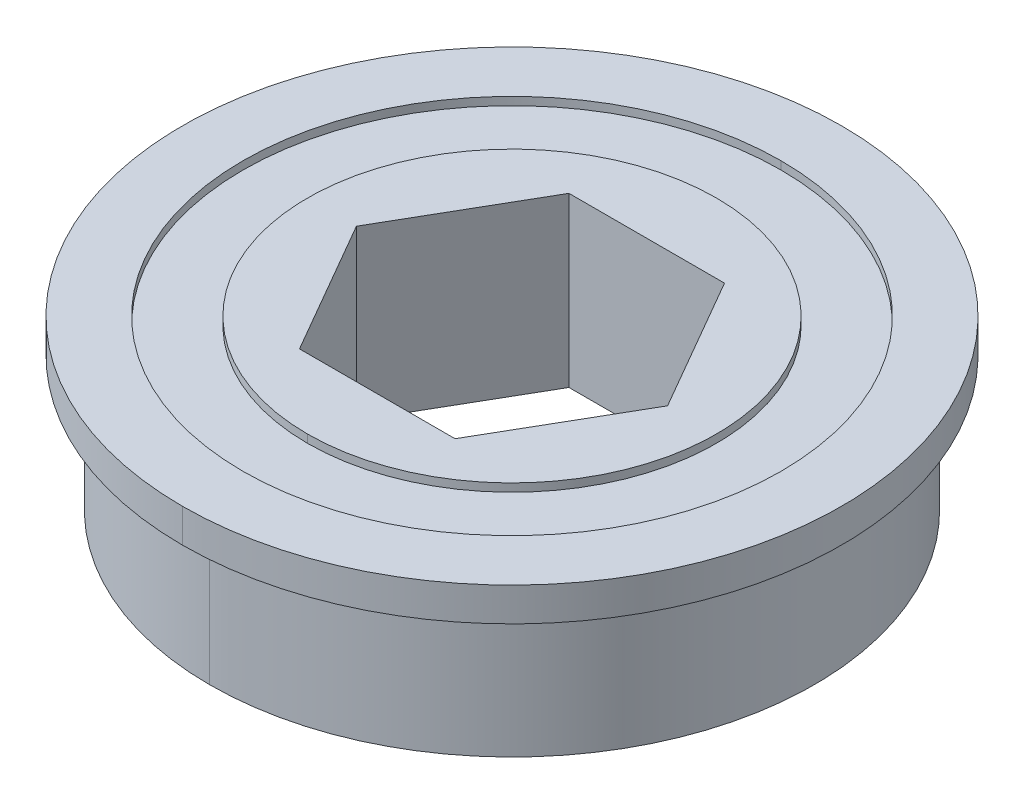
ISO-10303-21;
HEADER;
FILE_DESCRIPTION(('STEP AP214'),'2;1');
FILE_NAME('part.step','',(''),(''),'','','');
FILE_SCHEMA(('AUTOMOTIVE_DESIGN { 1 0 10303 214 1 1 1 1 }'));
ENDSEC;
DATA;
#1=APPLICATION_CONTEXT('core data for automotive mechanical design processes');
#2=APPLICATION_PROTOCOL_DEFINITION('international standard','automotive_design',2000,#1);
#3=PRODUCT_CONTEXT('',#1,'mechanical');
#4=PRODUCT('Part','Part','',(#3));
#5=PRODUCT_RELATED_PRODUCT_CATEGORY('part','',(#4));
#6=PRODUCT_DEFINITION_FORMATION('','',#4);
#7=PRODUCT_DEFINITION_CONTEXT('part definition',#1,'design');
#8=PRODUCT_DEFINITION('design','',#6,#7);
#9=PRODUCT_DEFINITION_SHAPE('','',#8);
#10=(LENGTH_UNIT() NAMED_UNIT(*) SI_UNIT(.MILLI.,.METRE.));
#11=(NAMED_UNIT(*) PLANE_ANGLE_UNIT() SI_UNIT($,.RADIAN.));
#12=(NAMED_UNIT(*) SI_UNIT($,.STERADIAN.) SOLID_ANGLE_UNIT());
#13=UNCERTAINTY_MEASURE_WITH_UNIT(LENGTH_MEASURE(1.E-05),#10,'distance_accuracy_value','');
#14=(GEOMETRIC_REPRESENTATION_CONTEXT(3) GLOBAL_UNCERTAINTY_ASSIGNED_CONTEXT((#13)) GLOBAL_UNIT_ASSIGNED_CONTEXT((#10,
#11,#12)) REPRESENTATION_CONTEXT('',''));
#15=CARTESIAN_POINT('',(0.,0.,0.));
#16=DIRECTION('',(0.,0.,1.));
#17=DIRECTION('',(1.,0.,0.));
#18=AXIS2_PLACEMENT_3D('',#15,#16,#17);
#19=CARTESIAN_POINT('',(3.67194771204602,0.,-6.36));
#20=DIRECTION('',(0.,0.,-1.));
#21=DIRECTION('',(-1.,0.,0.));
#22=AXIS2_PLACEMENT_3D('',#19,#20,#21);
#23=PLANE('',#22);
#24=DIRECTION('',(-1.,0.,0.));
#25=VECTOR('',#24,1.);
#26=CARTESIAN_POINT('',(3.67194771204602,7.9375,-6.36));
#27=LINE('',#26,#25);
#28=CARTESIAN_POINT('',(3.67194771204602,7.9375,-6.36));
#29=VERTEX_POINT('',#28);
#30=CARTESIAN_POINT('',(-3.67194771204602,7.9375,-6.36));
#31=VERTEX_POINT('',#30);
#32=EDGE_CURVE('E279',#29,#31,#27,.T.);
#33=ORIENTED_EDGE('',*,*,#32,.T.);
#34=DIRECTION('',(0.,1.,0.));
#35=VECTOR('',#34,1.);
#36=CARTESIAN_POINT('',(-3.67194771204602,0.,-6.36));
#37=LINE('',#36,#35);
#38=CARTESIAN_POINT('',(-3.67194771204602,0.,-6.36));
#39=VERTEX_POINT('',#38);
#40=EDGE_CURVE('E10',#39,#31,#37,.T.);
#41=ORIENTED_EDGE('',*,*,#40,.F.);
#42=DIRECTION('',(-1.,0.,0.));
#43=VECTOR('',#42,1.);
#44=CARTESIAN_POINT('',(3.67194771204602,0.,-6.36));
#45=LINE('',#44,#43);
#46=CARTESIAN_POINT('',(3.67194771204602,0.,-6.36));
#47=VERTEX_POINT('',#46);
#48=EDGE_CURVE('E259',#47,#39,#45,.T.);
#49=ORIENTED_EDGE('',*,*,#48,.F.);
#50=DIRECTION('',(0.,1.,0.));
#51=VECTOR('',#50,1.);
#52=CARTESIAN_POINT('',(3.67194771204602,0.,-6.36));
#53=LINE('',#52,#51);
#54=EDGE_CURVE('E275',#47,#29,#53,.T.);
#55=ORIENTED_EDGE('',*,*,#54,.T.);
#56=EDGE_LOOP('',(#33,#41,#49,#55));
#57=FACE_BOUND('',#56,.T.);
#58=ADVANCED_FACE('F16',(#57),#23,.F.);
#59=CARTESIAN_POINT('',(-3.67194771204602,0.,-6.36));
#60=DIRECTION('',(-0.866025403784439,0.,-0.5));
#61=DIRECTION('',(-0.5,0.,0.866025403784439));
#62=AXIS2_PLACEMENT_3D('',#59,#60,#61);
#63=PLANE('',#62);
#64=DIRECTION('',(-0.5,0.,0.866025403784439));
#65=VECTOR('',#64,1.);
#66=CARTESIAN_POINT('',(-3.67194771204602,7.9375,-6.36));
#67=LINE('',#66,#65);
#68=CARTESIAN_POINT('',(-7.34389542409204,7.9375,0.));
#69=VERTEX_POINT('',#68);
#70=EDGE_CURVE('E301',#31,#69,#67,.T.);
#71=ORIENTED_EDGE('',*,*,#70,.T.);
#72=DIRECTION('',(0.,1.,0.));
#73=VECTOR('',#72,1.);
#74=CARTESIAN_POINT('',(-7.34389542409204,0.,0.));
#75=LINE('',#74,#73);
#76=CARTESIAN_POINT('',(-7.34389542409204,0.,0.));
#77=VERTEX_POINT('',#76);
#78=EDGE_CURVE('E27',#77,#69,#75,.T.);
#79=ORIENTED_EDGE('',*,*,#78,.F.);
#80=DIRECTION('',(-0.5,0.,0.866025403784439));
#81=VECTOR('',#80,1.);
#82=CARTESIAN_POINT('',(-3.67194771204602,0.,-6.36));
#83=LINE('',#82,#81);
#84=EDGE_CURVE('E254',#39,#77,#83,.T.);
#85=ORIENTED_EDGE('',*,*,#84,.F.);
#86=ORIENTED_EDGE('',*,*,#40,.T.);
#87=EDGE_LOOP('',(#71,#79,#85,#86));
#88=FACE_BOUND('',#87,.T.);
#89=ADVANCED_FACE('F492',(#88),#63,.F.);
#90=CARTESIAN_POINT('',(-7.34389542409204,0.,0.));
#91=DIRECTION('',(-0.866025403784439,0.,0.5));
#92=DIRECTION('',(0.,1.,0.));
#93=AXIS2_PLACEMENT_3D('',#90,#91,#92);
#94=PLANE('',#93);
#95=DIRECTION('',(0.5,0.,0.866025403784439));
#96=VECTOR('',#95,1.);
#97=CARTESIAN_POINT('',(-7.34389542409204,7.9375,0.));
#98=LINE('',#97,#96);
#99=CARTESIAN_POINT('',(-3.67194771204601,7.9375,6.36));
#100=VERTEX_POINT('',#99);
#101=EDGE_CURVE('E304',#69,#100,#98,.T.);
#102=ORIENTED_EDGE('',*,*,#101,.T.);
#103=DIRECTION('',(0.,1.,0.));
#104=VECTOR('',#103,1.);
#105=CARTESIAN_POINT('',(-3.67194771204601,0.,6.36));
#106=LINE('',#105,#104);
#107=CARTESIAN_POINT('',(-3.67194771204601,0.,6.36));
#108=VERTEX_POINT('',#107);
#109=EDGE_CURVE('E341',#108,#100,#106,.T.);
#110=ORIENTED_EDGE('',*,*,#109,.F.);
#111=DIRECTION('',(0.5,0.,0.866025403784439));
#112=VECTOR('',#111,1.);
#113=CARTESIAN_POINT('',(-7.34389542409204,0.,0.));
#114=LINE('',#113,#112);
#115=EDGE_CURVE('E258',#77,#108,#114,.T.);
#116=ORIENTED_EDGE('',*,*,#115,.F.);
#117=ORIENTED_EDGE('',*,*,#78,.T.);
#118=EDGE_LOOP('',(#102,#110,#116,#117));
#119=FACE_BOUND('',#118,.T.);
#120=ADVANCED_FACE('F18',(#119),#94,.F.);
#121=CARTESIAN_POINT('',(-3.67194771204601,0.,6.36));
#122=DIRECTION('',(0.,0.,1.));
#123=DIRECTION('',(1.,0.,0.));
#124=AXIS2_PLACEMENT_3D('',#121,#122,#123);
#125=PLANE('',#124);
#126=DIRECTION('',(1.,0.,0.));
#127=VECTOR('',#126,1.);
#128=CARTESIAN_POINT('',(-3.67194771204601,7.9375,6.36));
#129=LINE('',#128,#127);
#130=CARTESIAN_POINT('',(3.67194771204602,7.9375,6.36));
#131=VERTEX_POINT('',#130);
#132=EDGE_CURVE('E322',#100,#131,#129,.T.);
#133=ORIENTED_EDGE('',*,*,#132,.T.);
#134=DIRECTION('',(0.,1.,0.));
#135=VECTOR('',#134,1.);
#136=CARTESIAN_POINT('',(3.67194771204602,0.,6.36));
#137=LINE('',#136,#135);
#138=CARTESIAN_POINT('',(3.67194771204602,0.,6.36));
#139=VERTEX_POINT('',#138);
#140=EDGE_CURVE('E338',#139,#131,#137,.T.);
#141=ORIENTED_EDGE('',*,*,#140,.F.);
#142=DIRECTION('',(1.,0.,0.));
#143=VECTOR('',#142,1.);
#144=CARTESIAN_POINT('',(-3.67194771204601,0.,6.36));
#145=LINE('',#144,#143);
#146=EDGE_CURVE('E384',#108,#139,#145,.T.);
#147=ORIENTED_EDGE('',*,*,#146,.F.);
#148=ORIENTED_EDGE('',*,*,#109,.T.);
#149=EDGE_LOOP('',(#133,#141,#147,#148));
#150=FACE_BOUND('',#149,.T.);
#151=ADVANCED_FACE('F512',(#150),#125,.F.);
#152=CARTESIAN_POINT('',(3.67194771204602,0.,6.36));
#153=DIRECTION('',(0.866025403784439,0.,0.5));
#154=DIRECTION('',(0.,-1.,0.));
#155=AXIS2_PLACEMENT_3D('',#152,#153,#154);
#156=PLANE('',#155);
#157=DIRECTION('',(0.5,0.,-0.866025403784439));
#158=VECTOR('',#157,1.);
#159=CARTESIAN_POINT('',(3.67194771204602,7.9375,6.36));
#160=LINE('',#159,#158);
#161=CARTESIAN_POINT('',(7.34389542409204,7.9375,0.));
#162=VERTEX_POINT('',#161);
#163=EDGE_CURVE('E315',#131,#162,#160,.T.);
#164=ORIENTED_EDGE('',*,*,#163,.T.);
#165=DIRECTION('',(0.,1.,0.));
#166=VECTOR('',#165,1.);
#167=CARTESIAN_POINT('',(7.34389542409204,0.,0.));
#168=LINE('',#167,#166);
#169=CARTESIAN_POINT('',(7.34389542409204,0.,0.));
#170=VERTEX_POINT('',#169);
#171=EDGE_CURVE('E278',#170,#162,#168,.T.);
#172=ORIENTED_EDGE('',*,*,#171,.F.);
#173=DIRECTION('',(0.5,0.,-0.866025403784439));
#174=VECTOR('',#173,1.);
#175=CARTESIAN_POINT('',(3.67194771204602,0.,6.36));
#176=LINE('',#175,#174);
#177=EDGE_CURVE('E316',#139,#170,#176,.T.);
#178=ORIENTED_EDGE('',*,*,#177,.F.);
#179=ORIENTED_EDGE('',*,*,#140,.T.);
#180=EDGE_LOOP('',(#164,#172,#178,#179));
#181=FACE_BOUND('',#180,.T.);
#182=ADVANCED_FACE('F514',(#181),#156,.F.);
#183=CARTESIAN_POINT('',(7.34389542409204,0.,0.));
#184=DIRECTION('',(0.866025403784439,0.,-0.5));
#185=DIRECTION('',(0.,-1.,0.));
#186=AXIS2_PLACEMENT_3D('',#183,#184,#185);
#187=PLANE('',#186);
#188=DIRECTION('',(-0.5,0.,-0.866025403784439));
#189=VECTOR('',#188,1.);
#190=CARTESIAN_POINT('',(7.34389542409204,7.9375,0.));
#191=LINE('',#190,#189);
#192=EDGE_CURVE('E311',#162,#29,#191,.T.);
#193=ORIENTED_EDGE('',*,*,#192,.T.);
#194=ORIENTED_EDGE('',*,*,#54,.F.);
#195=DIRECTION('',(-0.5,0.,-0.866025403784439));
#196=VECTOR('',#195,1.);
#197=CARTESIAN_POINT('',(7.34389542409204,0.,0.));
#198=LINE('',#197,#196);
#199=EDGE_CURVE('E260',#170,#47,#198,.T.);
#200=ORIENTED_EDGE('',*,*,#199,.F.);
#201=ORIENTED_EDGE('',*,*,#171,.T.);
#202=EDGE_LOOP('',(#193,#194,#200,#201));
#203=FACE_BOUND('',#202,.T.);
#204=ADVANCED_FACE('F572',(#203),#187,.F.);
#205=CARTESIAN_POINT('',(6.35,7.9375,0.));
#206=DIRECTION('',(0.,1.,0.));
#207=DIRECTION('',(1.,0.,0.));
#208=AXIS2_PLACEMENT_3D('',#205,#206,#207);
#209=PLANE('',#208);
#210=ORIENTED_EDGE('',*,*,#192,.F.);
#211=ORIENTED_EDGE('',*,*,#163,.F.);
#212=ORIENTED_EDGE('',*,*,#132,.F.);
#213=ORIENTED_EDGE('',*,*,#101,.F.);
#214=ORIENTED_EDGE('',*,*,#70,.F.);
#215=ORIENTED_EDGE('',*,*,#32,.F.);
#216=EDGE_LOOP('',(#210,#211,#212,#213,#214,#215));
#217=FACE_BOUND('',#216,.T.);
#218=CARTESIAN_POINT('',(0.,7.9375,0.));
#219=DIRECTION('',(0.,1.,0.));
#220=DIRECTION('',(0.,0.,1.));
#221=AXIS2_PLACEMENT_3D('',#218,#219,#220);
#222=CIRCLE('',#221,9.652);
#223=CARTESIAN_POINT('',(0.,7.9375,9.652));
#224=VERTEX_POINT('',#223);
#225=CARTESIAN_POINT('',(0.,7.9375,-9.652));
#226=VERTEX_POINT('',#225);
#227=EDGE_CURVE('E305',#224,#226,#222,.T.);
#228=ORIENTED_EDGE('',*,*,#227,.T.);
#229=CARTESIAN_POINT('',(0.,7.9375,0.));
#230=DIRECTION('',(0.,1.,0.));
#231=DIRECTION('',(0.,0.,1.));
#232=AXIS2_PLACEMENT_3D('',#229,#230,#231);
#233=CIRCLE('',#232,9.652);
#234=EDGE_CURVE('E397',#226,#224,#233,.T.);
#235=ORIENTED_EDGE('',*,*,#234,.T.);
#236=EDGE_LOOP('',(#228,#235));
#237=FACE_BOUND('',#236,.T.);
#238=ADVANCED_FACE('F537',(#217,#237),#209,.T.);
#239=CARTESIAN_POINT('',(9.652,0.,0.));
#240=DIRECTION('',(0.,-1.,0.));
#241=DIRECTION('',(0.,0.,-1.));
#242=AXIS2_PLACEMENT_3D('',#239,#240,#241);
#243=PLANE('',#242);
#244=ORIENTED_EDGE('',*,*,#199,.T.);
#245=ORIENTED_EDGE('',*,*,#48,.T.);
#246=ORIENTED_EDGE('',*,*,#84,.T.);
#247=ORIENTED_EDGE('',*,*,#115,.T.);
#248=ORIENTED_EDGE('',*,*,#146,.T.);
#249=ORIENTED_EDGE('',*,*,#177,.T.);
#250=EDGE_LOOP('',(#244,#245,#246,#247,#248,#249));
#251=FACE_BOUND('',#250,.T.);
#252=CARTESIAN_POINT('',(0.,0.,0.));
#253=DIRECTION('',(0.,1.,0.));
#254=DIRECTION('',(0.,0.,1.));
#255=AXIS2_PLACEMENT_3D('',#252,#253,#254);
#256=CIRCLE('',#255,9.652);
#257=CARTESIAN_POINT('',(0.,0.,9.652));
#258=VERTEX_POINT('',#257);
#259=CARTESIAN_POINT('',(0.,0.,-9.652));
#260=VERTEX_POINT('',#259);
#261=EDGE_CURVE('E245',#258,#260,#256,.T.);
#262=ORIENTED_EDGE('',*,*,#261,.F.);
#263=CARTESIAN_POINT('',(0.,0.,0.));
#264=DIRECTION('',(0.,1.,0.));
#265=DIRECTION('',(0.,0.,1.));
#266=AXIS2_PLACEMENT_3D('',#263,#264,#265);
#267=CIRCLE('',#266,9.652);
#268=EDGE_CURVE('E234',#260,#258,#267,.T.);
#269=ORIENTED_EDGE('',*,*,#268,.F.);
#270=EDGE_LOOP('',(#262,#269));
#271=FACE_BOUND('',#270,.T.);
#272=ADVANCED_FACE('F534',(#251,#271),#243,.T.);
#273=CARTESIAN_POINT('',(0.,0.,0.));
#274=DIRECTION('',(0.,1.,0.));
#275=DIRECTION('',(0.,0.,1.));
#276=AXIS2_PLACEMENT_3D('',#273,#274,#275);
#277=CYLINDRICAL_SURFACE('',#276,9.652);
#278=DIRECTION('',(0.,1.,0.));
#279=VECTOR('',#278,1.);
#280=CARTESIAN_POINT('',(0.,0.,-9.652));
#281=LINE('',#280,#279);
#282=CARTESIAN_POINT('',(0.,0.381,-9.652));
#283=VERTEX_POINT('',#282);
#284=EDGE_CURVE('E227',#260,#283,#281,.T.);
#285=ORIENTED_EDGE('',*,*,#284,.F.);
#286=ORIENTED_EDGE('',*,*,#268,.T.);
#287=DIRECTION('',(0.,1.,0.));
#288=VECTOR('',#287,1.);
#289=CARTESIAN_POINT('',(0.,0.,9.652));
#290=LINE('',#289,#288);
#291=CARTESIAN_POINT('',(0.,0.381,9.652));
#292=VERTEX_POINT('',#291);
#293=EDGE_CURVE('E230',#258,#292,#290,.T.);
#294=ORIENTED_EDGE('',*,*,#293,.T.);
#295=CARTESIAN_POINT('',(0.,0.381,0.));
#296=DIRECTION('',(0.,1.,0.));
#297=DIRECTION('',(0.,0.,1.));
#298=AXIS2_PLACEMENT_3D('',#295,#296,#297);
#299=CIRCLE('',#298,9.652);
#300=EDGE_CURVE('E223',#283,#292,#299,.T.);
#301=ORIENTED_EDGE('',*,*,#300,.F.);
#302=EDGE_LOOP('',(#285,#286,#294,#301));
#303=FACE_BOUND('',#302,.T.);
#304=ADVANCED_FACE('F225',(#303),#277,.T.);
#305=CARTESIAN_POINT('',(9.652,0.381,0.));
#306=DIRECTION('',(0.,-1.,0.));
#307=DIRECTION('',(0.,0.,-1.));
#308=AXIS2_PLACEMENT_3D('',#305,#306,#307);
#309=PLANE('',#308);
#310=CARTESIAN_POINT('',(0.,0.381,0.));
#311=DIRECTION('',(0.,1.,0.));
#312=DIRECTION('',(0.,0.,1.));
#313=AXIS2_PLACEMENT_3D('',#310,#311,#312);
#314=CIRCLE('',#313,9.652);
#315=EDGE_CURVE('E237',#292,#283,#314,.T.);
#316=ORIENTED_EDGE('',*,*,#315,.T.);
#317=ORIENTED_EDGE('',*,*,#300,.T.);
#318=EDGE_LOOP('',(#316,#317));
#319=FACE_BOUND('',#318,.T.);
#320=CARTESIAN_POINT('',(0.,0.381,0.));
#321=DIRECTION('',(0.,1.,0.));
#322=DIRECTION('',(0.,0.,1.));
#323=AXIS2_PLACEMENT_3D('',#320,#321,#322);
#324=CIRCLE('',#323,12.7);
#325=CARTESIAN_POINT('',(0.,0.381,12.7));
#326=VERTEX_POINT('',#325);
#327=CARTESIAN_POINT('',(0.,0.381,-12.7));
#328=VERTEX_POINT('',#327);
#329=EDGE_CURVE('E235',#326,#328,#324,.T.);
#330=ORIENTED_EDGE('',*,*,#329,.F.);
#331=CARTESIAN_POINT('',(0.,0.381,0.));
#332=DIRECTION('',(0.,1.,0.));
#333=DIRECTION('',(0.,0.,1.));
#334=AXIS2_PLACEMENT_3D('',#331,#332,#333);
#335=CIRCLE('',#334,12.7);
#336=EDGE_CURVE('E295',#328,#326,#335,.T.);
#337=ORIENTED_EDGE('',*,*,#336,.F.);
#338=EDGE_LOOP('',(#330,#337));
#339=FACE_BOUND('',#338,.T.);
#340=ADVANCED_FACE('F238',(#319,#339),#309,.T.);
#341=CARTESIAN_POINT('',(0.,0.,0.));
#342=DIRECTION('',(0.,1.,0.));
#343=DIRECTION('',(0.,0.,1.));
#344=AXIS2_PLACEMENT_3D('',#341,#342,#343);
#345=CYLINDRICAL_SURFACE('',#344,12.7);
#346=DIRECTION('',(0.,1.,0.));
#347=VECTOR('',#346,1.);
#348=CARTESIAN_POINT('',(0.,0.,-12.7));
#349=LINE('',#348,#347);
#350=CARTESIAN_POINT('',(0.,0.,-12.7));
#351=VERTEX_POINT('',#350);
#352=EDGE_CURVE('E291',#351,#328,#349,.T.);
#353=ORIENTED_EDGE('',*,*,#352,.F.);
#354=CARTESIAN_POINT('',(0.,0.,0.));
#355=DIRECTION('',(0.,1.,0.));
#356=DIRECTION('',(0.,0.,1.));
#357=AXIS2_PLACEMENT_3D('',#354,#355,#356);
#358=CIRCLE('',#357,12.7);
#359=CARTESIAN_POINT('',(0.,0.,12.7));
#360=VERTEX_POINT('',#359);
#361=EDGE_CURVE('E342',#360,#351,#358,.T.);
#362=ORIENTED_EDGE('',*,*,#361,.F.);
#363=DIRECTION('',(0.,1.,0.));
#364=VECTOR('',#363,1.);
#365=CARTESIAN_POINT('',(0.,0.,12.7));
#366=LINE('',#365,#364);
#367=EDGE_CURVE('E418',#360,#326,#366,.T.);
#368=ORIENTED_EDGE('',*,*,#367,.T.);
#369=ORIENTED_EDGE('',*,*,#329,.T.);
#370=EDGE_LOOP('',(#353,#362,#368,#369));
#371=FACE_BOUND('',#370,.T.);
#372=ADVANCED_FACE('F477',(#371),#345,.F.);
#373=CARTESIAN_POINT('',(14.2748,0.,0.));
#374=DIRECTION('',(0.,-1.,0.));
#375=DIRECTION('',(0.,0.,-1.));
#376=AXIS2_PLACEMENT_3D('',#373,#374,#375);
#377=PLANE('',#376);
#378=ORIENTED_EDGE('',*,*,#361,.T.);
#379=CARTESIAN_POINT('',(0.,0.,0.));
#380=DIRECTION('',(0.,1.,0.));
#381=DIRECTION('',(0.,0.,1.));
#382=AXIS2_PLACEMENT_3D('',#379,#380,#381);
#383=CIRCLE('',#382,12.7);
#384=EDGE_CURVE('E282',#351,#360,#383,.T.);
#385=ORIENTED_EDGE('',*,*,#384,.T.);
#386=EDGE_LOOP('',(#378,#385));
#387=FACE_BOUND('',#386,.T.);
#388=CARTESIAN_POINT('',(0.,0.,0.));
#389=DIRECTION('',(0.,1.,0.));
#390=DIRECTION('',(0.,0.,1.));
#391=AXIS2_PLACEMENT_3D('',#388,#389,#390);
#392=CIRCLE('',#391,14.2748);
#393=CARTESIAN_POINT('',(0.,0.,14.2748));
#394=VERTEX_POINT('',#393);
#395=CARTESIAN_POINT('',(0.,0.,-14.2748));
#396=VERTEX_POINT('',#395);
#397=EDGE_CURVE('E363',#394,#396,#392,.T.);
#398=ORIENTED_EDGE('',*,*,#397,.F.);
#399=CARTESIAN_POINT('',(0.,0.,0.));
#400=DIRECTION('',(0.,1.,0.));
#401=DIRECTION('',(0.,0.,1.));
#402=AXIS2_PLACEMENT_3D('',#399,#400,#401);
#403=CIRCLE('',#402,14.2748);
#404=EDGE_CURVE('E111',#396,#394,#403,.T.);
#405=ORIENTED_EDGE('',*,*,#404,.F.);
#406=EDGE_LOOP('',(#398,#405));
#407=FACE_BOUND('',#406,.T.);
#408=ADVANCED_FACE('F475',(#387,#407),#377,.T.);
#409=CARTESIAN_POINT('',(0.,0.,0.));
#410=DIRECTION('',(0.,1.,0.));
#411=DIRECTION('',(0.,0.,1.));
#412=AXIS2_PLACEMENT_3D('',#409,#410,#411);
#413=CYLINDRICAL_SURFACE('',#412,14.2748);
#414=DIRECTION('',(0.,1.,0.));
#415=VECTOR('',#414,1.);
#416=CARTESIAN_POINT('',(0.,0.,-14.2748));
#417=LINE('',#416,#415);
#418=CARTESIAN_POINT('',(0.,5.6,-14.2748));
#419=VERTEX_POINT('',#418);
#420=EDGE_CURVE('E358',#396,#419,#417,.T.);
#421=ORIENTED_EDGE('',*,*,#420,.F.);
#422=ORIENTED_EDGE('',*,*,#404,.T.);
#423=DIRECTION('',(0.,1.,0.));
#424=VECTOR('',#423,1.);
#425=CARTESIAN_POINT('',(0.,0.,14.2748));
#426=LINE('',#425,#424);
#427=CARTESIAN_POINT('',(0.,5.6,14.2748));
#428=VERTEX_POINT('',#427);
#429=EDGE_CURVE('E404',#394,#428,#426,.T.);
#430=ORIENTED_EDGE('',*,*,#429,.T.);
#431=CARTESIAN_POINT('',(0.,5.6,0.));
#432=DIRECTION('',(0.,1.,0.));
#433=DIRECTION('',(0.,0.,1.));
#434=AXIS2_PLACEMENT_3D('',#431,#432,#433);
#435=CIRCLE('',#434,14.2748);
#436=EDGE_CURVE('E96',#419,#428,#435,.T.);
#437=ORIENTED_EDGE('',*,*,#436,.F.);
#438=EDGE_LOOP('',(#421,#422,#430,#437));
#439=FACE_BOUND('',#438,.T.);
#440=ADVANCED_FACE('F472',(#439),#413,.T.);
#441=CARTESIAN_POINT('',(0.,5.975,0.));
#442=DIRECTION('',(0.,-1.,0.));
#443=DIRECTION('',(0.,0.,-1.));
#444=AXIS2_PLACEMENT_3D('',#441,#442,#443);
#445=CONICAL_SURFACE('',#444,14.0582936490539,0.523598775598298);
#446=DIRECTION('',(0.,-0.86602540378444,0.5));
#447=VECTOR('',#446,1.);
#448=CARTESIAN_POINT('',(0.,5.975,14.0582936490539));
#449=LINE('',#448,#447);
#450=CARTESIAN_POINT('',(0.,5.975,14.0582936490539));
#451=VERTEX_POINT('',#450);
#452=EDGE_CURVE('E274',#451,#428,#449,.T.);
#453=ORIENTED_EDGE('',*,*,#452,.F.);
#454=CARTESIAN_POINT('',(0.,5.975,0.));
#455=DIRECTION('',(0.,1.,0.));
#456=DIRECTION('',(0.,0.,1.));
#457=AXIS2_PLACEMENT_3D('',#454,#455,#456);
#458=CIRCLE('',#457,14.0582936490539);
#459=CARTESIAN_POINT('',(0.,5.975,-14.0582936490539));
#460=VERTEX_POINT('',#459);
#461=EDGE_CURVE('E290',#460,#451,#458,.T.);
#462=ORIENTED_EDGE('',*,*,#461,.F.);
#463=DIRECTION('',(0.,-0.86602540378444,-0.5));
#464=VECTOR('',#463,1.);
#465=CARTESIAN_POINT('',(0.,5.975,-14.0582936490539));
#466=LINE('',#465,#464);
#467=EDGE_CURVE('E270',#460,#419,#466,.T.);
#468=ORIENTED_EDGE('',*,*,#467,.T.);
#469=ORIENTED_EDGE('',*,*,#436,.T.);
#470=EDGE_LOOP('',(#453,#462,#468,#469));
#471=FACE_BOUND('',#470,.T.);
#472=ADVANCED_FACE('F485',(#471),#445,.T.);
#473=CARTESIAN_POINT('',(0.,6.1,0.));
#474=DIRECTION('',(0.,1.,0.));
#475=DIRECTION('',(0.,0.,1.));
#476=AXIS2_PLACEMENT_3D('',#473,#474,#475);
#477=TOROIDAL_SURFACE('',#476,14.2748,0.25);
#478=CARTESIAN_POINT('',(0.,6.1,0.));
#479=DIRECTION('',(0.,1.,0.));
#480=DIRECTION('',(0.,0.,1.));
#481=AXIS2_PLACEMENT_3D('',#478,#479,#480);
#482=CIRCLE('',#481,14.0248);
#483=CARTESIAN_POINT('',(0.,6.1,14.0248));
#484=VERTEX_POINT('',#483);
#485=CARTESIAN_POINT('',(0.,6.1,-14.0248));
#486=VERTEX_POINT('',#485);
#487=EDGE_CURVE('E317',#484,#486,#482,.T.);
#488=ORIENTED_EDGE('',*,*,#487,.F.);
#489=CARTESIAN_POINT('',(0.,6.1,14.2748));
#490=DIRECTION('',(-1.,0.,0.));
#491=DIRECTION('',(0.,0.,1.));
#492=AXIS2_PLACEMENT_3D('',#489,#490,#491);
#493=CIRCLE('',#492,0.25);
#494=EDGE_CURVE('E351',#484,#451,#493,.T.);
#495=ORIENTED_EDGE('',*,*,#494,.T.);
#496=CARTESIAN_POINT('',(0.,5.975,0.));
#497=DIRECTION('',(0.,1.,0.));
#498=DIRECTION('',(0.,0.,1.));
#499=AXIS2_PLACEMENT_3D('',#496,#497,#498);
#500=CIRCLE('',#499,14.0582936490539);
#501=EDGE_CURVE('E401',#451,#460,#500,.T.);
#502=ORIENTED_EDGE('',*,*,#501,.T.);
#503=CARTESIAN_POINT('',(0.,6.1,-14.2748));
#504=DIRECTION('',(1.,0.,0.));
#505=DIRECTION('',(0.,0.,-1.));
#506=AXIS2_PLACEMENT_3D('',#503,#504,#505);
#507=CIRCLE('',#506,0.25);
#508=EDGE_CURVE('E273',#486,#460,#507,.T.);
#509=ORIENTED_EDGE('',*,*,#508,.F.);
#510=EDGE_LOOP('',(#488,#495,#502,#509));
#511=FACE_BOUND('',#510,.T.);
#512=ADVANCED_FACE('F524',(#511),#477,.F.);
#513=CARTESIAN_POINT('',(15.5575,6.35,0.));
#514=DIRECTION('',(0.,-1.,0.));
#515=DIRECTION('',(0.,0.,-1.));
#516=AXIS2_PLACEMENT_3D('',#513,#514,#515);
#517=PLANE('',#516);
#518=CARTESIAN_POINT('',(0.,6.35,0.));
#519=DIRECTION('',(0.,1.,0.));
#520=DIRECTION('',(0.,0.,1.));
#521=AXIS2_PLACEMENT_3D('',#518,#519,#520);
#522=CIRCLE('',#521,14.2748);
#523=CARTESIAN_POINT('',(0.,6.35,14.2748));
#524=VERTEX_POINT('',#523);
#525=CARTESIAN_POINT('',(0.,6.35,-14.2748));
#526=VERTEX_POINT('',#525);
#527=EDGE_CURVE('E300',#524,#526,#522,.T.);
#528=ORIENTED_EDGE('',*,*,#527,.T.);
#529=CARTESIAN_POINT('',(0.,6.35,0.));
#530=DIRECTION('',(0.,1.,0.));
#531=DIRECTION('',(0.,0.,1.));
#532=AXIS2_PLACEMENT_3D('',#529,#530,#531);
#533=CIRCLE('',#532,14.2748);
#534=EDGE_CURVE('E251',#526,#524,#533,.T.);
#535=ORIENTED_EDGE('',*,*,#534,.T.);
#536=EDGE_LOOP('',(#528,#535));
#537=FACE_BOUND('',#536,.T.);
#538=CARTESIAN_POINT('',(0.,6.35,0.));
#539=DIRECTION('',(0.,1.,0.));
#540=DIRECTION('',(0.,0.,1.));
#541=AXIS2_PLACEMENT_3D('',#538,#539,#540);
#542=CIRCLE('',#541,15.5575);
#543=CARTESIAN_POINT('',(0.,6.35,15.5575));
#544=VERTEX_POINT('',#543);
#545=CARTESIAN_POINT('',(0.,6.35,-15.5575));
#546=VERTEX_POINT('',#545);
#547=EDGE_CURVE('E355',#544,#546,#542,.T.);
#548=ORIENTED_EDGE('',*,*,#547,.F.);
#549=CARTESIAN_POINT('',(0.,6.35,0.));
#550=DIRECTION('',(0.,1.,0.));
#551=DIRECTION('',(0.,0.,1.));
#552=AXIS2_PLACEMENT_3D('',#549,#550,#551);
#553=CIRCLE('',#552,15.5575);
#554=EDGE_CURVE('E400',#546,#544,#553,.T.);
#555=ORIENTED_EDGE('',*,*,#554,.F.);
#556=EDGE_LOOP('',(#548,#555));
#557=FACE_BOUND('',#556,.T.);
#558=ADVANCED_FACE('F539',(#537,#557),#517,.T.);
#559=CARTESIAN_POINT('',(0.,0.,0.));
#560=DIRECTION('',(0.,1.,0.));
#561=DIRECTION('',(0.,0.,1.));
#562=AXIS2_PLACEMENT_3D('',#559,#560,#561);
#563=CYLINDRICAL_SURFACE('',#562,15.5575);
#564=DIRECTION('',(0.,1.,0.));
#565=VECTOR('',#564,1.);
#566=CARTESIAN_POINT('',(0.,0.,-15.5575));
#567=LINE('',#566,#565);
#568=CARTESIAN_POINT('',(0.,7.9375,-15.5575));
#569=VERTEX_POINT('',#568);
#570=EDGE_CURVE('E335',#546,#569,#567,.T.);
#571=ORIENTED_EDGE('',*,*,#570,.F.);
#572=ORIENTED_EDGE('',*,*,#554,.T.);
#573=DIRECTION('',(0.,1.,0.));
#574=VECTOR('',#573,1.);
#575=CARTESIAN_POINT('',(0.,0.,15.5575));
#576=LINE('',#575,#574);
#577=CARTESIAN_POINT('',(0.,7.9375,15.5575));
#578=VERTEX_POINT('',#577);
#579=EDGE_CURVE('E269',#544,#578,#576,.T.);
#580=ORIENTED_EDGE('',*,*,#579,.T.);
#581=CARTESIAN_POINT('',(0.,7.9375,0.));
#582=DIRECTION('',(0.,1.,0.));
#583=DIRECTION('',(0.,0.,1.));
#584=AXIS2_PLACEMENT_3D('',#581,#582,#583);
#585=CIRCLE('',#584,15.5575);
#586=EDGE_CURVE('E179',#569,#578,#585,.T.);
#587=ORIENTED_EDGE('',*,*,#586,.F.);
#588=EDGE_LOOP('',(#571,#572,#580,#587));
#589=FACE_BOUND('',#588,.T.);
#590=ADVANCED_FACE('F542',(#589),#563,.T.);
#591=CARTESIAN_POINT('',(12.7,7.9375,0.));
#592=DIRECTION('',(0.,1.,0.));
#593=DIRECTION('',(1.,0.,0.));
#594=AXIS2_PLACEMENT_3D('',#591,#592,#593);
#595=PLANE('',#594);
#596=CARTESIAN_POINT('',(0.,7.9375,0.));
#597=DIRECTION('',(0.,1.,0.));
#598=DIRECTION('',(0.,0.,1.));
#599=AXIS2_PLACEMENT_3D('',#596,#597,#598);
#600=CIRCLE('',#599,12.7);
#601=CARTESIAN_POINT('',(0.,7.9375,12.7));
#602=VERTEX_POINT('',#601);
#603=CARTESIAN_POINT('',(0.,7.9375,-12.7));
#604=VERTEX_POINT('',#603);
#605=EDGE_CURVE('E283',#602,#604,#600,.T.);
#606=ORIENTED_EDGE('',*,*,#605,.F.);
#607=CARTESIAN_POINT('',(0.,7.9375,0.));
#608=DIRECTION('',(0.,1.,0.));
#609=DIRECTION('',(0.,0.,1.));
#610=AXIS2_PLACEMENT_3D('',#607,#608,#609);
#611=CIRCLE('',#610,12.7);
#612=EDGE_CURVE('E331',#604,#602,#611,.T.);
#613=ORIENTED_EDGE('',*,*,#612,.F.);
#614=EDGE_LOOP('',(#606,#613));
#615=FACE_BOUND('',#614,.T.);
#616=CARTESIAN_POINT('',(0.,7.9375,0.));
#617=DIRECTION('',(0.,1.,0.));
#618=DIRECTION('',(0.,0.,1.));
#619=AXIS2_PLACEMENT_3D('',#616,#617,#618);
#620=CIRCLE('',#619,15.5575);
#621=EDGE_CURVE('E332',#578,#569,#620,.T.);
#622=ORIENTED_EDGE('',*,*,#621,.T.);
#623=ORIENTED_EDGE('',*,*,#586,.T.);
#624=EDGE_LOOP('',(#622,#623));
#625=FACE_BOUND('',#624,.T.);
#626=ADVANCED_FACE('F527',(#615,#625),#595,.T.);
#627=CARTESIAN_POINT('',(0.,0.,0.));
#628=DIRECTION('',(0.,1.,0.));
#629=DIRECTION('',(0.,0.,1.));
#630=AXIS2_PLACEMENT_3D('',#627,#628,#629);
#631=CYLINDRICAL_SURFACE('',#630,12.7);
#632=DIRECTION('',(0.,1.,0.));
#633=VECTOR('',#632,1.);
#634=CARTESIAN_POINT('',(0.,0.,-12.7));
#635=LINE('',#634,#633);
#636=CARTESIAN_POINT('',(0.,7.5565,-12.7));
#637=VERTEX_POINT('',#636);
#638=EDGE_CURVE('E268',#637,#604,#635,.T.);
#639=ORIENTED_EDGE('',*,*,#638,.F.);
#640=CARTESIAN_POINT('',(0.,7.5565,0.));
#641=DIRECTION('',(0.,1.,0.));
#642=DIRECTION('',(0.,0.,1.));
#643=AXIS2_PLACEMENT_3D('',#640,#641,#642);
#644=CIRCLE('',#643,12.7);
#645=CARTESIAN_POINT('',(0.,7.5565,12.7));
#646=VERTEX_POINT('',#645);
#647=EDGE_CURVE('E286',#646,#637,#644,.T.);
#648=ORIENTED_EDGE('',*,*,#647,.F.);
#649=DIRECTION('',(0.,1.,0.));
#650=VECTOR('',#649,1.);
#651=CARTESIAN_POINT('',(0.,0.,12.7));
#652=LINE('',#651,#650);
#653=EDGE_CURVE('E346',#646,#602,#652,.T.);
#654=ORIENTED_EDGE('',*,*,#653,.T.);
#655=ORIENTED_EDGE('',*,*,#605,.T.);
#656=EDGE_LOOP('',(#639,#648,#654,#655));
#657=FACE_BOUND('',#656,.T.);
#658=ADVANCED_FACE('F506',(#657),#631,.F.);
#659=CARTESIAN_POINT('',(9.652,7.5565,0.));
#660=DIRECTION('',(0.,1.,0.));
#661=DIRECTION('',(1.,0.,0.));
#662=AXIS2_PLACEMENT_3D('',#659,#660,#661);
#663=PLANE('',#662);
#664=CARTESIAN_POINT('',(0.,7.5565,0.));
#665=DIRECTION('',(0.,1.,0.));
#666=DIRECTION('',(0.,0.,1.));
#667=AXIS2_PLACEMENT_3D('',#664,#665,#666);
#668=CIRCLE('',#667,9.652);
#669=CARTESIAN_POINT('',(0.,7.5565,9.652));
#670=VERTEX_POINT('',#669);
#671=CARTESIAN_POINT('',(0.,7.5565,-9.652));
#672=VERTEX_POINT('',#671);
#673=EDGE_CURVE('E350',#670,#672,#668,.T.);
#674=ORIENTED_EDGE('',*,*,#673,.F.);
#675=CARTESIAN_POINT('',(0.,7.5565,0.));
#676=DIRECTION('',(0.,1.,0.));
#677=DIRECTION('',(0.,0.,1.));
#678=AXIS2_PLACEMENT_3D('',#675,#676,#677);
#679=CIRCLE('',#678,9.652);
#680=EDGE_CURVE('E394',#672,#670,#679,.T.);
#681=ORIENTED_EDGE('',*,*,#680,.F.);
#682=EDGE_LOOP('',(#674,#681));
#683=FACE_BOUND('',#682,.T.);
#684=ORIENTED_EDGE('',*,*,#647,.T.);
#685=CARTESIAN_POINT('',(0.,7.5565,0.));
#686=DIRECTION('',(0.,1.,0.));
#687=DIRECTION('',(0.,0.,1.));
#688=AXIS2_PLACEMENT_3D('',#685,#686,#687);
#689=CIRCLE('',#688,12.7);
#690=EDGE_CURVE('E264',#637,#646,#689,.T.);
#691=ORIENTED_EDGE('',*,*,#690,.T.);
#692=EDGE_LOOP('',(#684,#691));
#693=FACE_BOUND('',#692,.T.);
#694=ADVANCED_FACE('F502',(#683,#693),#663,.T.);
#695=CARTESIAN_POINT('',(0.,0.,0.));
#696=DIRECTION('',(0.,1.,0.));
#697=DIRECTION('',(0.,0.,1.));
#698=AXIS2_PLACEMENT_3D('',#695,#696,#697);
#699=CYLINDRICAL_SURFACE('',#698,9.652);
#700=DIRECTION('',(0.,1.,0.));
#701=VECTOR('',#700,1.);
#702=CARTESIAN_POINT('',(0.,0.,-9.652));
#703=LINE('',#702,#701);
#704=EDGE_CURVE('E310',#672,#226,#703,.T.);
#705=ORIENTED_EDGE('',*,*,#704,.F.);
#706=ORIENTED_EDGE('',*,*,#680,.T.);
#707=DIRECTION('',(0.,1.,0.));
#708=VECTOR('',#707,1.);
#709=CARTESIAN_POINT('',(0.,0.,9.652));
#710=LINE('',#709,#708);
#711=EDGE_CURVE('E309',#670,#224,#710,.T.);
#712=ORIENTED_EDGE('',*,*,#711,.T.);
#713=ORIENTED_EDGE('',*,*,#234,.F.);
#714=EDGE_LOOP('',(#705,#706,#712,#713));
#715=FACE_BOUND('',#714,.T.);
#716=ADVANCED_FACE('F505',(#715),#699,.T.);
#717=CARTESIAN_POINT('',(0.,0.,0.));
#718=DIRECTION('',(0.,1.,0.));
#719=DIRECTION('',(0.,0.,1.));
#720=AXIS2_PLACEMENT_3D('',#717,#718,#719);
#721=CYLINDRICAL_SURFACE('',#720,9.652);
#722=ORIENTED_EDGE('',*,*,#673,.T.);
#723=ORIENTED_EDGE('',*,*,#704,.T.);
#724=ORIENTED_EDGE('',*,*,#227,.F.);
#725=ORIENTED_EDGE('',*,*,#711,.F.);
#726=EDGE_LOOP('',(#722,#723,#724,#725));
#727=FACE_BOUND('',#726,.T.);
#728=ADVANCED_FACE('F546',(#727),#721,.T.);
#729=CARTESIAN_POINT('',(0.,0.,0.));
#730=DIRECTION('',(0.,1.,0.));
#731=DIRECTION('',(0.,0.,1.));
#732=AXIS2_PLACEMENT_3D('',#729,#730,#731);
#733=CYLINDRICAL_SURFACE('',#732,12.7);
#734=ORIENTED_EDGE('',*,*,#690,.F.);
#735=ORIENTED_EDGE('',*,*,#638,.T.);
#736=ORIENTED_EDGE('',*,*,#612,.T.);
#737=ORIENTED_EDGE('',*,*,#653,.F.);
#738=EDGE_LOOP('',(#734,#735,#736,#737));
#739=FACE_BOUND('',#738,.T.);
#740=ADVANCED_FACE('F563',(#739),#733,.F.);
#741=CARTESIAN_POINT('',(0.,0.,0.));
#742=DIRECTION('',(0.,1.,0.));
#743=DIRECTION('',(0.,0.,1.));
#744=AXIS2_PLACEMENT_3D('',#741,#742,#743);
#745=CYLINDRICAL_SURFACE('',#744,15.5575);
#746=ORIENTED_EDGE('',*,*,#547,.T.);
#747=ORIENTED_EDGE('',*,*,#570,.T.);
#748=ORIENTED_EDGE('',*,*,#621,.F.);
#749=ORIENTED_EDGE('',*,*,#579,.F.);
#750=EDGE_LOOP('',(#746,#747,#748,#749));
#751=FACE_BOUND('',#750,.T.);
#752=ADVANCED_FACE('F532',(#751),#745,.T.);
#753=CARTESIAN_POINT('',(0.,6.1,0.));
#754=DIRECTION('',(0.,1.,0.));
#755=DIRECTION('',(0.,0.,1.));
#756=AXIS2_PLACEMENT_3D('',#753,#754,#755);
#757=TOROIDAL_SURFACE('',#756,14.2748,0.25);
#758=CARTESIAN_POINT('',(0.,6.1,0.));
#759=DIRECTION('',(0.,1.,0.));
#760=DIRECTION('',(0.,0.,1.));
#761=AXIS2_PLACEMENT_3D('',#758,#759,#760);
#762=CIRCLE('',#761,14.0248);
#763=EDGE_CURVE('E296',#486,#484,#762,.T.);
#764=ORIENTED_EDGE('',*,*,#763,.F.);
#765=ORIENTED_EDGE('',*,*,#508,.T.);
#766=ORIENTED_EDGE('',*,*,#461,.T.);
#767=ORIENTED_EDGE('',*,*,#494,.F.);
#768=EDGE_LOOP('',(#764,#765,#766,#767));
#769=FACE_BOUND('',#768,.T.);
#770=ADVANCED_FACE('F529',(#769),#757,.F.);
#771=CARTESIAN_POINT('',(0.,5.975,0.));
#772=DIRECTION('',(0.,-1.,0.));
#773=DIRECTION('',(0.,0.,-1.));
#774=AXIS2_PLACEMENT_3D('',#771,#772,#773);
#775=CONICAL_SURFACE('',#774,14.0582936490539,0.523598775598298);
#776=ORIENTED_EDGE('',*,*,#501,.F.);
#777=ORIENTED_EDGE('',*,*,#452,.T.);
#778=CARTESIAN_POINT('',(0.,5.6,0.));
#779=DIRECTION('',(0.,1.,0.));
#780=DIRECTION('',(0.,0.,1.));
#781=AXIS2_PLACEMENT_3D('',#778,#779,#780);
#782=CIRCLE('',#781,14.2748);
#783=EDGE_CURVE('E362',#428,#419,#782,.T.);
#784=ORIENTED_EDGE('',*,*,#783,.T.);
#785=ORIENTED_EDGE('',*,*,#467,.F.);
#786=EDGE_LOOP('',(#776,#777,#784,#785));
#787=FACE_BOUND('',#786,.T.);
#788=ADVANCED_FACE('F467',(#787),#775,.T.);
#789=CARTESIAN_POINT('',(0.,0.,0.));
#790=DIRECTION('',(0.,1.,0.));
#791=DIRECTION('',(0.,0.,1.));
#792=AXIS2_PLACEMENT_3D('',#789,#790,#791);
#793=CYLINDRICAL_SURFACE('',#792,14.2748);
#794=ORIENTED_EDGE('',*,*,#397,.T.);
#795=ORIENTED_EDGE('',*,*,#420,.T.);
#796=ORIENTED_EDGE('',*,*,#783,.F.);
#797=ORIENTED_EDGE('',*,*,#429,.F.);
#798=EDGE_LOOP('',(#794,#795,#796,#797));
#799=FACE_BOUND('',#798,.T.);
#800=ADVANCED_FACE('F474',(#799),#793,.T.);
#801=CARTESIAN_POINT('',(0.,0.,0.));
#802=DIRECTION('',(0.,1.,0.));
#803=DIRECTION('',(0.,0.,1.));
#804=AXIS2_PLACEMENT_3D('',#801,#802,#803);
#805=CYLINDRICAL_SURFACE('',#804,12.7);
#806=ORIENTED_EDGE('',*,*,#384,.F.);
#807=ORIENTED_EDGE('',*,*,#352,.T.);
#808=ORIENTED_EDGE('',*,*,#336,.T.);
#809=ORIENTED_EDGE('',*,*,#367,.F.);
#810=EDGE_LOOP('',(#806,#807,#808,#809));
#811=FACE_BOUND('',#810,.T.);
#812=ADVANCED_FACE('F508',(#811),#805,.F.);
#813=CARTESIAN_POINT('',(0.,0.,0.));
#814=DIRECTION('',(0.,1.,0.));
#815=DIRECTION('',(0.,0.,1.));
#816=AXIS2_PLACEMENT_3D('',#813,#814,#815);
#817=CYLINDRICAL_SURFACE('',#816,9.652);
#818=ORIENTED_EDGE('',*,*,#261,.T.);
#819=ORIENTED_EDGE('',*,*,#284,.T.);
#820=ORIENTED_EDGE('',*,*,#315,.F.);
#821=ORIENTED_EDGE('',*,*,#293,.F.);
#822=EDGE_LOOP('',(#818,#819,#820,#821));
#823=FACE_BOUND('',#822,.T.);
#824=ADVANCED_FACE('F243',(#823),#817,.T.);
#825=CARTESIAN_POINT('',(0.,6.1,0.));
#826=DIRECTION('',(0.,1.,0.));
#827=DIRECTION('',(0.,0.,1.));
#828=AXIS2_PLACEMENT_3D('',#825,#826,#827);
#829=TOROIDAL_SURFACE('',#828,14.2748,0.25);
#830=CARTESIAN_POINT('',(0.,6.1,-14.2748));
#831=DIRECTION('',(1.,0.,0.));
#832=DIRECTION('',(0.,0.,-1.));
#833=AXIS2_PLACEMENT_3D('',#830,#831,#832);
#834=CIRCLE('',#833,0.25);
#835=EDGE_CURVE('E321',#526,#486,#834,.T.);
#836=ORIENTED_EDGE('',*,*,#835,.T.);
#837=ORIENTED_EDGE('',*,*,#763,.T.);
#838=CARTESIAN_POINT('',(0.,6.1,14.2748));
#839=DIRECTION('',(-1.,0.,0.));
#840=DIRECTION('',(0.,0.,1.));
#841=AXIS2_PLACEMENT_3D('',#838,#839,#840);
#842=CIRCLE('',#841,0.25);
#843=EDGE_CURVE('E20',#524,#484,#842,.T.);
#844=ORIENTED_EDGE('',*,*,#843,.F.);
#845=ORIENTED_EDGE('',*,*,#534,.F.);
#846=EDGE_LOOP('',(#836,#837,#844,#845));
#847=FACE_BOUND('',#846,.T.);
#848=ADVANCED_FACE('F520',(#847),#829,.F.);
#849=CARTESIAN_POINT('',(0.,6.1,0.));
#850=DIRECTION('',(0.,1.,0.));
#851=DIRECTION('',(0.,0.,1.));
#852=AXIS2_PLACEMENT_3D('',#849,#850,#851);
#853=TOROIDAL_SURFACE('',#852,14.2748,0.25);
#854=ORIENTED_EDGE('',*,*,#843,.T.);
#855=ORIENTED_EDGE('',*,*,#487,.T.);
#856=ORIENTED_EDGE('',*,*,#835,.F.);
#857=ORIENTED_EDGE('',*,*,#527,.F.);
#858=EDGE_LOOP('',(#854,#855,#856,#857));
#859=FACE_BOUND('',#858,.T.);
#860=ADVANCED_FACE('F517',(#859),#853,.F.);
#861=CLOSED_SHELL('',(#58,#89,#120,#151,#182,#204,#238,#272,#304,#340,#372,#408,#440,#472,#512,
#558,#590,#626,#658,#694,#716,#728,#740,#752,#770,#788,#800,#812,#824,#848,#860));
#862=MANIFOLD_SOLID_BREP('B1',#861);
#863=ADVANCED_BREP_SHAPE_REPRESENTATION('',(#18,#862),#14);
#864=SHAPE_DEFINITION_REPRESENTATION(#9,#863);
ENDSEC;
END-ISO-10303-21;
